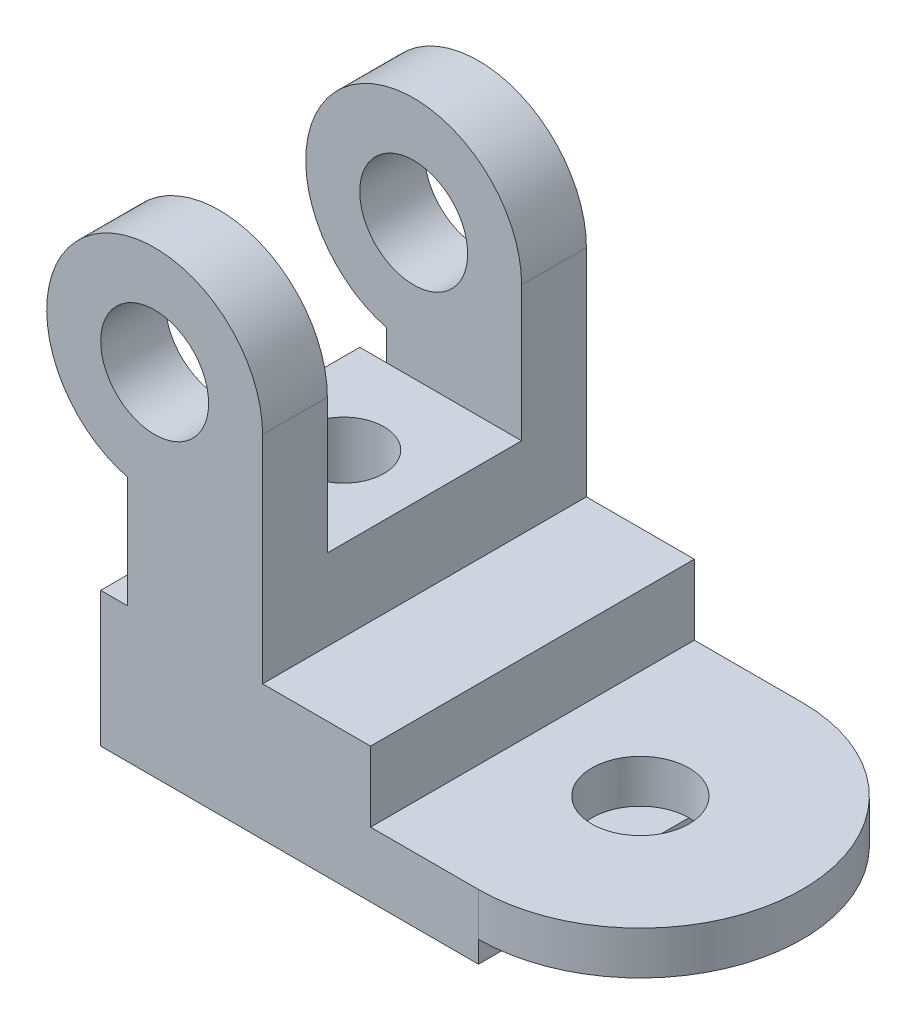
ISO-10303-21;
HEADER;
FILE_DESCRIPTION(('STEP AP214'),'2;1');
FILE_NAME('part.step','',(''),(''),'','','');
FILE_SCHEMA(('AUTOMOTIVE_DESIGN { 1 0 10303 214 1 1 1 1 }'));
ENDSEC;
DATA;
#1=APPLICATION_CONTEXT('core data for automotive mechanical design processes');
#2=APPLICATION_PROTOCOL_DEFINITION('international standard','automotive_design',2000,#1);
#3=PRODUCT_CONTEXT('',#1,'mechanical');
#4=PRODUCT('Part','Part','',(#3));
#5=PRODUCT_RELATED_PRODUCT_CATEGORY('part','',(#4));
#6=PRODUCT_DEFINITION_FORMATION('','',#4);
#7=PRODUCT_DEFINITION_CONTEXT('part definition',#1,'design');
#8=PRODUCT_DEFINITION('design','',#6,#7);
#9=PRODUCT_DEFINITION_SHAPE('','',#8);
#10=(LENGTH_UNIT() NAMED_UNIT(*) SI_UNIT(.MILLI.,.METRE.));
#11=(NAMED_UNIT(*) PLANE_ANGLE_UNIT() SI_UNIT($,.RADIAN.));
#12=(NAMED_UNIT(*) SI_UNIT($,.STERADIAN.) SOLID_ANGLE_UNIT());
#13=UNCERTAINTY_MEASURE_WITH_UNIT(LENGTH_MEASURE(1.E-05),#10,'distance_accuracy_value','');
#14=(GEOMETRIC_REPRESENTATION_CONTEXT(3) GLOBAL_UNCERTAINTY_ASSIGNED_CONTEXT((#13)) GLOBAL_UNIT_ASSIGNED_CONTEXT((#10,
#11,#12)) REPRESENTATION_CONTEXT('',''));
#15=CARTESIAN_POINT('',(0.,0.,0.));
#16=DIRECTION('',(0.,0.,1.));
#17=DIRECTION('',(1.,0.,0.));
#18=AXIS2_PLACEMENT_3D('',#15,#16,#17);
#19=CARTESIAN_POINT('',(-30.,0.,30.));
#20=DIRECTION('',(1.,0.,0.));
#21=DIRECTION('',(0.,1.,0.));
#22=AXIS2_PLACEMENT_3D('',#19,#20,#21);
#23=PLANE('',#22);
#24=DIRECTION('',(0.,-1.,0.));
#25=VECTOR('',#24,1.);
#26=CARTESIAN_POINT('',(-30.,0.,18.));
#27=LINE('',#26,#25);
#28=CARTESIAN_POINT('',(-30.,45.6350832689629,18.));
#29=VERTEX_POINT('',#28);
#30=CARTESIAN_POINT('',(-30.,40.,18.));
#31=VERTEX_POINT('',#30);
#32=EDGE_CURVE('E226',#29,#31,#27,.T.);
#33=ORIENTED_EDGE('',*,*,#32,.T.);
#34=DIRECTION('',(0.,-1.,0.));
#35=VECTOR('',#34,1.);
#36=CARTESIAN_POINT('',(-30.,0.,18.));
#37=LINE('',#36,#35);
#38=CARTESIAN_POINT('',(-30.,25.,18.));
#39=VERTEX_POINT('',#38);
#40=EDGE_CURVE('E484',#31,#39,#37,.T.);
#41=ORIENTED_EDGE('',*,*,#40,.T.);
#42=DIRECTION('',(0.,0.,-1.));
#43=VECTOR('',#42,1.);
#44=CARTESIAN_POINT('',(-30.,25.,30.));
#45=LINE('',#44,#43);
#46=CARTESIAN_POINT('',(-30.,25.,30.));
#47=VERTEX_POINT('',#46);
#48=EDGE_CURVE('E186',#47,#39,#45,.T.);
#49=ORIENTED_EDGE('',*,*,#48,.F.);
#50=DIRECTION('',(0.,-1.,0.));
#51=VECTOR('',#50,1.);
#52=CARTESIAN_POINT('',(-30.,0.,30.));
#53=LINE('',#52,#51);
#54=CARTESIAN_POINT('',(-30.,45.6350832689629,30.));
#55=VERTEX_POINT('',#54);
#56=EDGE_CURVE('E264',#55,#47,#53,.T.);
#57=ORIENTED_EDGE('',*,*,#56,.F.);
#58=DIRECTION('',(0.,0.,-1.));
#59=VECTOR('',#58,1.);
#60=CARTESIAN_POINT('',(-30.,45.6350832689629,30.));
#61=LINE('',#60,#59);
#62=EDGE_CURVE('E202',#55,#29,#61,.T.);
#63=ORIENTED_EDGE('',*,*,#62,.T.);
#64=EDGE_LOOP('',(#33,#41,#49,#57,#63));
#65=FACE_BOUND('',#64,.T.);
#66=ADVANCED_FACE('F35',(#65),#23,.F.);
#67=CARTESIAN_POINT('',(0.,25.,30.));
#68=DIRECTION('',(0.,-1.,0.));
#69=DIRECTION('',(0.,0.,-1.));
#70=AXIS2_PLACEMENT_3D('',#67,#68,#69);
#71=PLANE('',#70);
#72=ORIENTED_EDGE('',*,*,#48,.T.);
#73=DIRECTION('',(1.,0.,0.));
#74=VECTOR('',#73,1.);
#75=CARTESIAN_POINT('',(-4.99999999999999,25.,18.));
#76=LINE('',#75,#74);
#77=CARTESIAN_POINT('',(-35.,25.,18.));
#78=VERTEX_POINT('',#77);
#79=EDGE_CURVE('E171',#78,#39,#76,.T.);
#80=ORIENTED_EDGE('',*,*,#79,.F.);
#81=DIRECTION('',(0.,0.,-1.));
#82=VECTOR('',#81,1.);
#83=CARTESIAN_POINT('',(-35.,25.,30.));
#84=LINE('',#83,#82);
#85=CARTESIAN_POINT('',(-35.,25.,30.));
#86=VERTEX_POINT('',#85);
#87=EDGE_CURVE('E183',#86,#78,#84,.T.);
#88=ORIENTED_EDGE('',*,*,#87,.F.);
#89=DIRECTION('',(-1.,0.,0.));
#90=VECTOR('',#89,1.);
#91=CARTESIAN_POINT('',(0.,25.,30.));
#92=LINE('',#91,#90);
#93=EDGE_CURVE('E267',#47,#86,#92,.T.);
#94=ORIENTED_EDGE('',*,*,#93,.F.);
#95=EDGE_LOOP('',(#72,#80,#88,#94));
#96=FACE_BOUND('',#95,.T.);
#97=ADVANCED_FACE('F182',(#96),#71,.F.);
#98=CARTESIAN_POINT('',(-25.,65.,30.));
#99=DIRECTION('',(0.,0.,-1.));
#100=DIRECTION('',(-1.,0.,0.));
#101=AXIS2_PLACEMENT_3D('',#98,#99,#100);
#102=CYLINDRICAL_SURFACE('',#101,20.);
#103=CARTESIAN_POINT('',(-30.,45.6350832689629,-18.));
#104=VERTEX_POINT('',#103);
#105=CARTESIAN_POINT('',(-30.,45.6350832689629,-30.));
#106=VERTEX_POINT('',#105);
#107=EDGE_CURVE('E201',#104,#106,#61,.T.);
#108=ORIENTED_EDGE('',*,*,#107,.F.);
#109=CARTESIAN_POINT('',(-25.,65.,-18.));
#110=DIRECTION('',(0.,0.,-1.));
#111=DIRECTION('',(0.,1.,0.));
#112=AXIS2_PLACEMENT_3D('',#109,#110,#111);
#113=CIRCLE('',#112,20.);
#114=CARTESIAN_POINT('',(-5.,65.,-18.));
#115=VERTEX_POINT('',#114);
#116=EDGE_CURVE('E211',#104,#115,#113,.T.);
#117=ORIENTED_EDGE('',*,*,#116,.T.);
#118=DIRECTION('',(0.,0.,-1.));
#119=VECTOR('',#118,1.);
#120=CARTESIAN_POINT('',(-5.,65.,30.));
#121=LINE('',#120,#119);
#122=CARTESIAN_POINT('',(-5.,65.,-30.));
#123=VERTEX_POINT('',#122);
#124=EDGE_CURVE('E44',#115,#123,#121,.T.);
#125=ORIENTED_EDGE('',*,*,#124,.T.);
#126=CARTESIAN_POINT('',(-25.,65.,-30.));
#127=DIRECTION('',(0.,0.,1.));
#128=DIRECTION('',(1.,0.,0.));
#129=AXIS2_PLACEMENT_3D('',#126,#127,#128);
#130=CIRCLE('',#129,20.);
#131=EDGE_CURVE('E290',#123,#106,#130,.T.);
#132=ORIENTED_EDGE('',*,*,#131,.T.);
#133=EDGE_LOOP('',(#108,#117,#125,#132));
#134=FACE_BOUND('',#133,.T.);
#135=ADVANCED_FACE('F346',(#134),#102,.T.);
#136=CARTESIAN_POINT('',(-25.,65.,30.));
#137=DIRECTION('',(0.,0.,-1.));
#138=DIRECTION('',(-1.,0.,0.));
#139=AXIS2_PLACEMENT_3D('',#136,#137,#138);
#140=CYLINDRICAL_SURFACE('',#139,10.);
#141=CARTESIAN_POINT('',(-25.,65.,18.));
#142=DIRECTION('',(0.,0.,1.));
#143=DIRECTION('',(0.,-1.,0.));
#144=AXIS2_PLACEMENT_3D('',#141,#142,#143);
#145=CIRCLE('',#144,10.);
#146=CARTESIAN_POINT('',(-25.,55.,18.));
#147=VERTEX_POINT('',#146);
#148=EDGE_CURVE('E39',#147,#147,#145,.T.);
#149=ORIENTED_EDGE('',*,*,#148,.F.);
#150=EDGE_LOOP('',(#149));
#151=FACE_BOUND('',#150,.T.);
#152=CARTESIAN_POINT('',(-25.,65.,30.));
#153=DIRECTION('',(0.,0.,1.));
#154=DIRECTION('',(1.,0.,0.));
#155=AXIS2_PLACEMENT_3D('',#152,#153,#154);
#156=CIRCLE('',#155,10.);
#157=CARTESIAN_POINT('',(-15.,65.,30.));
#158=VERTEX_POINT('',#157);
#159=EDGE_CURVE('E254',#158,#158,#156,.T.);
#160=ORIENTED_EDGE('',*,*,#159,.T.);
#161=EDGE_LOOP('',(#160));
#162=FACE_BOUND('',#161,.T.);
#163=ADVANCED_FACE('F411',(#151,#162),#140,.F.);
#164=CARTESIAN_POINT('',(35.,0.,30.));
#165=DIRECTION('',(-1.,0.,0.));
#166=DIRECTION('',(0.,0.,1.));
#167=AXIS2_PLACEMENT_3D('',#164,#165,#166);
#168=PLANE('',#167);
#169=DIRECTION('',(0.,0.,-1.));
#170=VECTOR('',#169,1.);
#171=CARTESIAN_POINT('',(35.,4.00000000000001,30.));
#172=LINE('',#171,#170);
#173=CARTESIAN_POINT('',(35.,4.00000000000001,30.));
#174=VERTEX_POINT('',#173);
#175=CARTESIAN_POINT('',(35.,4.00000000000001,9.));
#176=VERTEX_POINT('',#175);
#177=EDGE_CURVE('E249',#174,#176,#172,.T.);
#178=ORIENTED_EDGE('',*,*,#177,.F.);
#179=DIRECTION('',(0.,1.,0.));
#180=VECTOR('',#179,1.);
#181=CARTESIAN_POINT('',(35.,0.,30.));
#182=LINE('',#181,#180);
#183=CARTESIAN_POINT('',(35.,0.,30.));
#184=VERTEX_POINT('',#183);
#185=EDGE_CURVE('E273',#184,#174,#182,.T.);
#186=ORIENTED_EDGE('',*,*,#185,.F.);
#187=DIRECTION('',(0.,0.,-1.));
#188=VECTOR('',#187,1.);
#189=CARTESIAN_POINT('',(35.,0.,30.));
#190=LINE('',#189,#188);
#191=CARTESIAN_POINT('',(35.,0.,-30.));
#192=VERTEX_POINT('',#191);
#193=EDGE_CURVE('E322',#184,#192,#190,.T.);
#194=ORIENTED_EDGE('',*,*,#193,.T.);
#195=DIRECTION('',(0.,1.,0.));
#196=VECTOR('',#195,1.);
#197=CARTESIAN_POINT('',(35.,0.,-30.));
#198=LINE('',#197,#196);
#199=CARTESIAN_POINT('',(35.,4.00000000000001,-30.));
#200=VERTEX_POINT('',#199);
#201=EDGE_CURVE('E305',#192,#200,#198,.T.);
#202=ORIENTED_EDGE('',*,*,#201,.T.);
#203=CARTESIAN_POINT('',(35.,4.00000000000001,-9.));
#204=VERTEX_POINT('',#203);
#205=EDGE_CURVE('E247',#204,#200,#172,.T.);
#206=ORIENTED_EDGE('',*,*,#205,.F.);
#207=EDGE_CURVE('E253',#176,#204,#172,.T.);
#208=ORIENTED_EDGE('',*,*,#207,.F.);
#209=EDGE_LOOP('',(#178,#186,#194,#202,#206,#208));
#210=FACE_BOUND('',#209,.T.);
#211=ADVANCED_FACE('F369',(#210),#168,.F.);
#212=CARTESIAN_POINT('',(-4.99999999999999,0.,30.));
#213=DIRECTION('',(1.,0.,0.));
#214=DIRECTION('',(0.,1.,0.));
#215=AXIS2_PLACEMENT_3D('',#212,#213,#214);
#216=PLANE('',#215);
#217=DIRECTION('',(0.,1.,0.));
#218=VECTOR('',#217,1.);
#219=CARTESIAN_POINT('',(-5.00000000000001,104.778485803222,-18.));
#220=LINE('',#219,#218);
#221=CARTESIAN_POINT('',(-5.,40.,-18.));
#222=VERTEX_POINT('',#221);
#223=EDGE_CURVE('E220',#222,#115,#220,.T.);
#224=ORIENTED_EDGE('',*,*,#223,.F.);
#225=DIRECTION('',(0.,0.,-1.));
#226=VECTOR('',#225,1.);
#227=CARTESIAN_POINT('',(-5.,40.,18.));
#228=LINE('',#227,#226);
#229=CARTESIAN_POINT('',(-5.,40.,18.));
#230=VERTEX_POINT('',#229);
#231=EDGE_CURVE('E488',#230,#222,#228,.T.);
#232=ORIENTED_EDGE('',*,*,#231,.F.);
#233=DIRECTION('',(0.,-1.,0.));
#234=VECTOR('',#233,1.);
#235=CARTESIAN_POINT('',(-5.00000000000001,104.778485803222,18.));
#236=LINE('',#235,#234);
#237=CARTESIAN_POINT('',(-5.,65.,18.));
#238=VERTEX_POINT('',#237);
#239=EDGE_CURVE('E486',#238,#230,#236,.T.);
#240=ORIENTED_EDGE('',*,*,#239,.F.);
#241=CARTESIAN_POINT('',(-5.,65.,30.));
#242=VERTEX_POINT('',#241);
#243=EDGE_CURVE('E11',#242,#238,#121,.T.);
#244=ORIENTED_EDGE('',*,*,#243,.F.);
#245=DIRECTION('',(0.,-1.,0.));
#246=VECTOR('',#245,1.);
#247=CARTESIAN_POINT('',(-4.99999999999999,0.,30.));
#248=LINE('',#247,#246);
#249=CARTESIAN_POINT('',(-5.,25.,30.));
#250=VERTEX_POINT('',#249);
#251=EDGE_CURVE('E257',#242,#250,#248,.T.);
#252=ORIENTED_EDGE('',*,*,#251,.T.);
#253=DIRECTION('',(0.,0.,-1.));
#254=VECTOR('',#253,1.);
#255=CARTESIAN_POINT('',(-5.,25.,30.));
#256=LINE('',#255,#254);
#257=CARTESIAN_POINT('',(-5.,25.,-30.));
#258=VERTEX_POINT('',#257);
#259=EDGE_CURVE('E284',#250,#258,#256,.T.);
#260=ORIENTED_EDGE('',*,*,#259,.T.);
#261=DIRECTION('',(0.,-1.,0.));
#262=VECTOR('',#261,1.);
#263=CARTESIAN_POINT('',(-4.99999999999999,0.,-30.));
#264=LINE('',#263,#262);
#265=EDGE_CURVE('E287',#123,#258,#264,.T.);
#266=ORIENTED_EDGE('',*,*,#265,.F.);
#267=ORIENTED_EDGE('',*,*,#124,.F.);
#268=EDGE_LOOP('',(#224,#232,#240,#244,#252,#260,#266,#267));
#269=FACE_BOUND('',#268,.T.);
#270=ADVANCED_FACE('F351',(#269),#216,.T.);
#271=ORIENTED_EDGE('',*,*,#243,.T.);
#272=CARTESIAN_POINT('',(-25.,65.,18.));
#273=DIRECTION('',(0.,0.,1.));
#274=DIRECTION('',(0.,-1.,0.));
#275=AXIS2_PLACEMENT_3D('',#272,#273,#274);
#276=CIRCLE('',#275,20.);
#277=EDGE_CURVE('E229',#238,#29,#276,.T.);
#278=ORIENTED_EDGE('',*,*,#277,.T.);
#279=ORIENTED_EDGE('',*,*,#62,.F.);
#280=CARTESIAN_POINT('',(-25.,65.,30.));
#281=DIRECTION('',(0.,0.,1.));
#282=DIRECTION('',(1.,0.,0.));
#283=AXIS2_PLACEMENT_3D('',#280,#281,#282);
#284=CIRCLE('',#283,20.);
#285=EDGE_CURVE('E261',#242,#55,#284,.T.);
#286=ORIENTED_EDGE('',*,*,#285,.F.);
#287=EDGE_LOOP('',(#271,#278,#279,#286));
#288=FACE_BOUND('',#287,.T.);
#289=ADVANCED_FACE('F401',(#288),#102,.T.);
#290=CARTESIAN_POINT('',(-30.,25.,-18.));
#291=VERTEX_POINT('',#290);
#292=CARTESIAN_POINT('',(-30.,25.,-30.));
#293=VERTEX_POINT('',#292);
#294=EDGE_CURVE('E193',#291,#293,#45,.T.);
#295=ORIENTED_EDGE('',*,*,#294,.F.);
#296=DIRECTION('',(0.,1.,0.));
#297=VECTOR('',#296,1.);
#298=CARTESIAN_POINT('',(-30.,0.,-18.));
#299=LINE('',#298,#297);
#300=CARTESIAN_POINT('',(-30.,40.,-18.));
#301=VERTEX_POINT('',#300);
#302=EDGE_CURVE('E177',#291,#301,#299,.T.);
#303=ORIENTED_EDGE('',*,*,#302,.T.);
#304=DIRECTION('',(0.,1.,0.));
#305=VECTOR('',#304,1.);
#306=CARTESIAN_POINT('',(-30.,0.,-18.));
#307=LINE('',#306,#305);
#308=EDGE_CURVE('E206',#301,#104,#307,.T.);
#309=ORIENTED_EDGE('',*,*,#308,.T.);
#310=ORIENTED_EDGE('',*,*,#107,.T.);
#311=DIRECTION('',(0.,-1.,0.));
#312=VECTOR('',#311,1.);
#313=CARTESIAN_POINT('',(-30.,0.,-30.));
#314=LINE('',#313,#312);
#315=EDGE_CURVE('E293',#106,#293,#314,.T.);
#316=ORIENTED_EDGE('',*,*,#315,.T.);
#317=EDGE_LOOP('',(#295,#303,#309,#310,#316));
#318=FACE_BOUND('',#317,.T.);
#319=ADVANCED_FACE('F342',(#318),#23,.F.);
#320=CARTESIAN_POINT('',(-35.,25.,-18.));
#321=VERTEX_POINT('',#320);
#322=CARTESIAN_POINT('',(-35.,25.,-30.));
#323=VERTEX_POINT('',#322);
#324=EDGE_CURVE('E194',#321,#323,#84,.T.);
#325=ORIENTED_EDGE('',*,*,#324,.F.);
#326=DIRECTION('',(-1.,0.,0.));
#327=VECTOR('',#326,1.);
#328=CARTESIAN_POINT('',(-4.99999999999999,25.,-18.));
#329=LINE('',#328,#327);
#330=EDGE_CURVE('E187',#291,#321,#329,.T.);
#331=ORIENTED_EDGE('',*,*,#330,.F.);
#332=ORIENTED_EDGE('',*,*,#294,.T.);
#333=DIRECTION('',(-1.,0.,0.));
#334=VECTOR('',#333,1.);
#335=CARTESIAN_POINT('',(0.,25.,-30.));
#336=LINE('',#335,#334);
#337=EDGE_CURVE('E296',#293,#323,#336,.T.);
#338=ORIENTED_EDGE('',*,*,#337,.T.);
#339=EDGE_LOOP('',(#325,#331,#332,#338));
#340=FACE_BOUND('',#339,.T.);
#341=ADVANCED_FACE('F337',(#340),#71,.F.);
#342=CARTESIAN_POINT('',(-35.,0.,30.));
#343=DIRECTION('',(-1.,0.,0.));
#344=DIRECTION('',(0.,0.,1.));
#345=AXIS2_PLACEMENT_3D('',#342,#343,#344);
#346=PLANE('',#345);
#347=DIRECTION('',(0.,1.,0.));
#348=VECTOR('',#347,1.);
#349=CARTESIAN_POINT('',(-35.,0.,-30.));
#350=LINE('',#349,#348);
#351=CARTESIAN_POINT('',(-35.,0.,-30.));
#352=VERTEX_POINT('',#351);
#353=EDGE_CURVE('E299',#352,#323,#350,.T.);
#354=ORIENTED_EDGE('',*,*,#353,.F.);
#355=DIRECTION('',(0.,0.,-1.));
#356=VECTOR('',#355,1.);
#357=CARTESIAN_POINT('',(-35.,0.,30.));
#358=LINE('',#357,#356);
#359=CARTESIAN_POINT('',(-35.,0.,30.));
#360=VERTEX_POINT('',#359);
#361=EDGE_CURVE('E197',#360,#352,#358,.T.);
#362=ORIENTED_EDGE('',*,*,#361,.F.);
#363=DIRECTION('',(0.,1.,0.));
#364=VECTOR('',#363,1.);
#365=CARTESIAN_POINT('',(-35.,0.,30.));
#366=LINE('',#365,#364);
#367=EDGE_CURVE('E192',#360,#86,#366,.T.);
#368=ORIENTED_EDGE('',*,*,#367,.T.);
#369=ORIENTED_EDGE('',*,*,#87,.T.);
#370=DIRECTION('',(0.,1.,0.));
#371=VECTOR('',#370,1.);
#372=CARTESIAN_POINT('',(-35.,25.,18.));
#373=LINE('',#372,#371);
#374=CARTESIAN_POINT('',(-35.,40.,18.));
#375=VERTEX_POINT('',#374);
#376=EDGE_CURVE('E168',#78,#375,#373,.T.);
#377=ORIENTED_EDGE('',*,*,#376,.T.);
#378=DIRECTION('',(0.,0.,1.));
#379=VECTOR('',#378,1.);
#380=CARTESIAN_POINT('',(-35.,40.,-18.));
#381=LINE('',#380,#379);
#382=CARTESIAN_POINT('',(-35.,40.,-18.));
#383=VERTEX_POINT('',#382);
#384=EDGE_CURVE('E479',#383,#375,#381,.T.);
#385=ORIENTED_EDGE('',*,*,#384,.F.);
#386=DIRECTION('',(0.,1.,0.));
#387=VECTOR('',#386,1.);
#388=CARTESIAN_POINT('',(-35.,25.,-18.));
#389=LINE('',#388,#387);
#390=EDGE_CURVE('E52',#321,#383,#389,.T.);
#391=ORIENTED_EDGE('',*,*,#390,.F.);
#392=ORIENTED_EDGE('',*,*,#324,.T.);
#393=EDGE_LOOP('',(#354,#362,#368,#369,#377,#385,#391,#392));
#394=FACE_BOUND('',#393,.T.);
#395=ADVANCED_FACE('F190',(#394),#346,.T.);
#396=CARTESIAN_POINT('',(0.,0.,30.));
#397=DIRECTION('',(0.,1.,0.));
#398=DIRECTION('',(0.,0.,1.));
#399=AXIS2_PLACEMENT_3D('',#396,#397,#398);
#400=PLANE('',#399);
#401=CARTESIAN_POINT('',(-20.,0.,0.));
#402=DIRECTION('',(0.,1.,0.));
#403=DIRECTION('',(-1.,0.,0.));
#404=AXIS2_PLACEMENT_3D('',#401,#402,#403);
#405=CIRCLE('',#404,7.5);
#406=CARTESIAN_POINT('',(-27.5,0.,0.));
#407=VERTEX_POINT('',#406);
#408=EDGE_CURVE('E469',#407,#407,#405,.T.);
#409=ORIENTED_EDGE('',*,*,#408,.T.);
#410=EDGE_LOOP('',(#409));
#411=FACE_BOUND('',#410,.T.);
#412=DIRECTION('',(1.,0.,0.));
#413=VECTOR('',#412,1.);
#414=CARTESIAN_POINT('',(0.,0.,-30.));
#415=LINE('',#414,#413);
#416=EDGE_CURVE('E302',#352,#192,#415,.T.);
#417=ORIENTED_EDGE('',*,*,#416,.T.);
#418=ORIENTED_EDGE('',*,*,#193,.F.);
#419=DIRECTION('',(1.,0.,0.));
#420=VECTOR('',#419,1.);
#421=CARTESIAN_POINT('',(0.,0.,30.));
#422=LINE('',#421,#420);
#423=EDGE_CURVE('E270',#360,#184,#422,.T.);
#424=ORIENTED_EDGE('',*,*,#423,.F.);
#425=ORIENTED_EDGE('',*,*,#361,.T.);
#426=EDGE_LOOP('',(#417,#418,#424,#425));
#427=FACE_BOUND('',#426,.T.);
#428=ADVANCED_FACE('F329',(#411,#427),#400,.F.);
#429=CARTESIAN_POINT('',(0.,12.,30.));
#430=DIRECTION('',(0.,-1.,0.));
#431=DIRECTION('',(0.,0.,-1.));
#432=AXIS2_PLACEMENT_3D('',#429,#430,#431);
#433=PLANE('',#432);
#434=CARTESIAN_POINT('',(35.,12.,0.));
#435=DIRECTION('',(0.,1.,0.));
#436=DIRECTION('',(0.,0.,1.));
#437=AXIS2_PLACEMENT_3D('',#434,#435,#436);
#438=CIRCLE('',#437,9.);
#439=CARTESIAN_POINT('',(35.,12.,9.));
#440=VERTEX_POINT('',#439);
#441=EDGE_CURVE('E231',#440,#440,#438,.T.);
#442=ORIENTED_EDGE('',*,*,#441,.F.);
#443=EDGE_LOOP('',(#442));
#444=FACE_BOUND('',#443,.T.);
#445=DIRECTION('',(-1.,0.,0.));
#446=VECTOR('',#445,1.);
#447=CARTESIAN_POINT('',(0.,12.,-30.));
#448=LINE('',#447,#446);
#449=CARTESIAN_POINT('',(35.,12.,-30.));
#450=VERTEX_POINT('',#449);
#451=CARTESIAN_POINT('',(15.,12.,-30.));
#452=VERTEX_POINT('',#451);
#453=EDGE_CURVE('E308',#450,#452,#448,.T.);
#454=ORIENTED_EDGE('',*,*,#453,.T.);
#455=DIRECTION('',(0.,0.,-1.));
#456=VECTOR('',#455,1.);
#457=CARTESIAN_POINT('',(15.,12.,30.));
#458=LINE('',#457,#456);
#459=CARTESIAN_POINT('',(15.,12.,30.));
#460=VERTEX_POINT('',#459);
#461=EDGE_CURVE('E320',#460,#452,#458,.T.);
#462=ORIENTED_EDGE('',*,*,#461,.F.);
#463=DIRECTION('',(-1.,0.,0.));
#464=VECTOR('',#463,1.);
#465=CARTESIAN_POINT('',(0.,12.,30.));
#466=LINE('',#465,#464);
#467=CARTESIAN_POINT('',(35.,12.,30.));
#468=VERTEX_POINT('',#467);
#469=EDGE_CURVE('E276',#468,#460,#466,.T.);
#470=ORIENTED_EDGE('',*,*,#469,.F.);
#471=CARTESIAN_POINT('',(35.,12.,0.));
#472=DIRECTION('',(0.,1.,0.));
#473=DIRECTION('',(0.,0.,1.));
#474=AXIS2_PLACEMENT_3D('',#471,#472,#473);
#475=CIRCLE('',#474,30.);
#476=EDGE_CURVE('E235',#468,#450,#475,.T.);
#477=ORIENTED_EDGE('',*,*,#476,.T.);
#478=EDGE_LOOP('',(#454,#462,#470,#477));
#479=FACE_BOUND('',#478,.T.);
#480=ADVANCED_FACE('F362',(#444,#479),#433,.F.);
#481=CARTESIAN_POINT('',(15.,0.,30.));
#482=DIRECTION('',(-1.,0.,0.));
#483=DIRECTION('',(0.,0.,1.));
#484=AXIS2_PLACEMENT_3D('',#481,#482,#483);
#485=PLANE('',#484);
#486=DIRECTION('',(0.,1.,0.));
#487=VECTOR('',#486,1.);
#488=CARTESIAN_POINT('',(15.,0.,-30.));
#489=LINE('',#488,#487);
#490=CARTESIAN_POINT('',(15.,25.,-30.));
#491=VERTEX_POINT('',#490);
#492=EDGE_CURVE('E311',#452,#491,#489,.T.);
#493=ORIENTED_EDGE('',*,*,#492,.T.);
#494=DIRECTION('',(0.,0.,-1.));
#495=VECTOR('',#494,1.);
#496=CARTESIAN_POINT('',(15.,25.,30.));
#497=LINE('',#496,#495);
#498=CARTESIAN_POINT('',(15.,25.,30.));
#499=VERTEX_POINT('',#498);
#500=EDGE_CURVE('E317',#499,#491,#497,.T.);
#501=ORIENTED_EDGE('',*,*,#500,.F.);
#502=DIRECTION('',(0.,1.,0.));
#503=VECTOR('',#502,1.);
#504=CARTESIAN_POINT('',(15.,0.,30.));
#505=LINE('',#504,#503);
#506=EDGE_CURVE('E279',#460,#499,#505,.T.);
#507=ORIENTED_EDGE('',*,*,#506,.F.);
#508=ORIENTED_EDGE('',*,*,#461,.T.);
#509=EDGE_LOOP('',(#493,#501,#507,#508));
#510=FACE_BOUND('',#509,.T.);
#511=ADVANCED_FACE('F359',(#510),#485,.F.);
#512=CARTESIAN_POINT('',(-25.,65.,-18.));
#513=DIRECTION('',(0.,0.,-1.));
#514=DIRECTION('',(0.,1.,0.));
#515=AXIS2_PLACEMENT_3D('',#512,#513,#514);
#516=CIRCLE('',#515,10.);
#517=CARTESIAN_POINT('',(-25.,75.,-18.));
#518=VERTEX_POINT('',#517);
#519=EDGE_CURVE('E204',#518,#518,#516,.T.);
#520=ORIENTED_EDGE('',*,*,#519,.F.);
#521=EDGE_LOOP('',(#520));
#522=FACE_BOUND('',#521,.T.);
#523=CARTESIAN_POINT('',(-25.,65.,-30.));
#524=DIRECTION('',(0.,0.,1.));
#525=DIRECTION('',(1.,0.,0.));
#526=AXIS2_PLACEMENT_3D('',#523,#524,#525);
#527=CIRCLE('',#526,10.);
#528=CARTESIAN_POINT('',(-15.,65.,-30.));
#529=VERTEX_POINT('',#528);
#530=EDGE_CURVE('E252',#529,#529,#527,.T.);
#531=ORIENTED_EDGE('',*,*,#530,.F.);
#532=EDGE_LOOP('',(#531));
#533=FACE_BOUND('',#532,.T.);
#534=ADVANCED_FACE('F37',(#522,#533),#140,.F.);
#535=CARTESIAN_POINT('',(0.,25.,30.));
#536=DIRECTION('',(0.,-1.,0.));
#537=DIRECTION('',(1.,0.,0.));
#538=AXIS2_PLACEMENT_3D('',#535,#536,#537);
#539=PLANE('',#538);
#540=DIRECTION('',(-1.,0.,0.));
#541=VECTOR('',#540,1.);
#542=CARTESIAN_POINT('',(0.,25.,-30.));
#543=LINE('',#542,#541);
#544=EDGE_CURVE('E258',#491,#258,#543,.T.);
#545=ORIENTED_EDGE('',*,*,#544,.T.);
#546=ORIENTED_EDGE('',*,*,#259,.F.);
#547=DIRECTION('',(-1.,0.,0.));
#548=VECTOR('',#547,1.);
#549=CARTESIAN_POINT('',(0.,25.,30.));
#550=LINE('',#549,#548);
#551=EDGE_CURVE('E282',#499,#250,#550,.T.);
#552=ORIENTED_EDGE('',*,*,#551,.F.);
#553=ORIENTED_EDGE('',*,*,#500,.T.);
#554=EDGE_LOOP('',(#545,#546,#552,#553));
#555=FACE_BOUND('',#554,.T.);
#556=ADVANCED_FACE('F355',(#555),#539,.F.);
#557=CARTESIAN_POINT('',(0.,0.,30.));
#558=DIRECTION('',(0.,0.,1.));
#559=DIRECTION('',(1.,0.,0.));
#560=AXIS2_PLACEMENT_3D('',#557,#558,#559);
#561=PLANE('',#560);
#562=ORIENTED_EDGE('',*,*,#469,.T.);
#563=ORIENTED_EDGE('',*,*,#506,.T.);
#564=ORIENTED_EDGE('',*,*,#551,.T.);
#565=ORIENTED_EDGE('',*,*,#251,.F.);
#566=ORIENTED_EDGE('',*,*,#285,.T.);
#567=ORIENTED_EDGE('',*,*,#56,.T.);
#568=ORIENTED_EDGE('',*,*,#93,.T.);
#569=ORIENTED_EDGE('',*,*,#367,.F.);
#570=ORIENTED_EDGE('',*,*,#423,.T.);
#571=ORIENTED_EDGE('',*,*,#185,.T.);
#572=DIRECTION('',(0.,1.,0.));
#573=VECTOR('',#572,1.);
#574=CARTESIAN_POINT('',(35.,4.00000000000001,30.));
#575=LINE('',#574,#573);
#576=EDGE_CURVE('E241',#174,#468,#575,.T.);
#577=ORIENTED_EDGE('',*,*,#576,.T.);
#578=EDGE_LOOP('',(#562,#563,#564,#565,#566,#567,#568,#569,#570,#571,#577));
#579=FACE_BOUND('',#578,.T.);
#580=ORIENTED_EDGE('',*,*,#159,.F.);
#581=EDGE_LOOP('',(#580));
#582=FACE_BOUND('',#581,.T.);
#583=ADVANCED_FACE('F426',(#579,#582),#561,.T.);
#584=CARTESIAN_POINT('',(0.,0.,-30.));
#585=DIRECTION('',(0.,0.,1.));
#586=DIRECTION('',(1.,0.,0.));
#587=AXIS2_PLACEMENT_3D('',#584,#585,#586);
#588=PLANE('',#587);
#589=ORIENTED_EDGE('',*,*,#530,.T.);
#590=EDGE_LOOP('',(#589));
#591=FACE_BOUND('',#590,.T.);
#592=ORIENTED_EDGE('',*,*,#492,.F.);
#593=ORIENTED_EDGE('',*,*,#453,.F.);
#594=DIRECTION('',(0.,1.,0.));
#595=VECTOR('',#594,1.);
#596=CARTESIAN_POINT('',(35.,4.00000000000001,-30.));
#597=LINE('',#596,#595);
#598=EDGE_CURVE('E244',#200,#450,#597,.T.);
#599=ORIENTED_EDGE('',*,*,#598,.F.);
#600=ORIENTED_EDGE('',*,*,#201,.F.);
#601=ORIENTED_EDGE('',*,*,#416,.F.);
#602=ORIENTED_EDGE('',*,*,#353,.T.);
#603=ORIENTED_EDGE('',*,*,#337,.F.);
#604=ORIENTED_EDGE('',*,*,#315,.F.);
#605=ORIENTED_EDGE('',*,*,#131,.F.);
#606=ORIENTED_EDGE('',*,*,#265,.T.);
#607=ORIENTED_EDGE('',*,*,#544,.F.);
#608=EDGE_LOOP('',(#592,#593,#599,#600,#601,#602,#603,#604,#605,#606,#607));
#609=FACE_BOUND('',#608,.T.);
#610=ADVANCED_FACE('F331',(#591,#609),#588,.F.);
#611=CARTESIAN_POINT('',(35.,4.00000000000001,0.));
#612=DIRECTION('',(0.,1.,0.));
#613=DIRECTION('',(0.,0.,1.));
#614=AXIS2_PLACEMENT_3D('',#611,#612,#613);
#615=PLANE('',#614);
#616=ORIENTED_EDGE('',*,*,#177,.T.);
#617=CARTESIAN_POINT('',(35.,4.00000000000001,0.));
#618=DIRECTION('',(0.,1.,0.));
#619=DIRECTION('',(0.,0.,1.));
#620=AXIS2_PLACEMENT_3D('',#617,#618,#619);
#621=CIRCLE('',#620,9.);
#622=EDGE_CURVE('E232',#176,#204,#621,.T.);
#623=ORIENTED_EDGE('',*,*,#622,.T.);
#624=ORIENTED_EDGE('',*,*,#205,.T.);
#625=CARTESIAN_POINT('',(35.,4.00000000000001,0.));
#626=DIRECTION('',(0.,1.,0.));
#627=DIRECTION('',(0.,0.,1.));
#628=AXIS2_PLACEMENT_3D('',#625,#626,#627);
#629=CIRCLE('',#628,30.);
#630=EDGE_CURVE('E238',#174,#200,#629,.T.);
#631=ORIENTED_EDGE('',*,*,#630,.F.);
#632=EDGE_LOOP('',(#616,#623,#624,#631));
#633=FACE_BOUND('',#632,.T.);
#634=ADVANCED_FACE('F374',(#633),#615,.F.);
#635=CARTESIAN_POINT('',(35.,4.00000000000001,0.));
#636=DIRECTION('',(0.,1.,0.));
#637=DIRECTION('',(0.,0.,1.));
#638=AXIS2_PLACEMENT_3D('',#635,#636,#637);
#639=CYLINDRICAL_SURFACE('',#638,30.);
#640=ORIENTED_EDGE('',*,*,#476,.F.);
#641=ORIENTED_EDGE('',*,*,#576,.F.);
#642=ORIENTED_EDGE('',*,*,#630,.T.);
#643=ORIENTED_EDGE('',*,*,#598,.T.);
#644=EDGE_LOOP('',(#640,#641,#642,#643));
#645=FACE_BOUND('',#644,.T.);
#646=ADVANCED_FACE('F366',(#645),#639,.T.);
#647=CARTESIAN_POINT('',(35.,4.00000000000001,0.));
#648=DIRECTION('',(0.,1.,0.));
#649=DIRECTION('',(0.,0.,1.));
#650=AXIS2_PLACEMENT_3D('',#647,#648,#649);
#651=PLANE('',#650);
#652=ORIENTED_EDGE('',*,*,#207,.T.);
#653=EDGE_CURVE('E59',#204,#176,#621,.T.);
#654=ORIENTED_EDGE('',*,*,#653,.T.);
#655=EDGE_LOOP('',(#652,#654));
#656=FACE_BOUND('',#655,.T.);
#657=ADVANCED_FACE('F373',(#656),#651,.T.);
#658=CARTESIAN_POINT('',(35.,4.00000000000001,0.));
#659=DIRECTION('',(0.,1.,0.));
#660=DIRECTION('',(0.,0.,1.));
#661=AXIS2_PLACEMENT_3D('',#658,#659,#660);
#662=CYLINDRICAL_SURFACE('',#661,9.);
#663=ORIENTED_EDGE('',*,*,#622,.F.);
#664=ORIENTED_EDGE('',*,*,#653,.F.);
#665=EDGE_LOOP('',(#663,#664));
#666=FACE_BOUND('',#665,.T.);
#667=ORIENTED_EDGE('',*,*,#441,.T.);
#668=EDGE_LOOP('',(#667));
#669=FACE_BOUND('',#668,.T.);
#670=ADVANCED_FACE('F375',(#666,#669),#662,.F.);
#671=CARTESIAN_POINT('',(-45.,40.,18.));
#672=DIRECTION('',(0.,-1.,0.));
#673=DIRECTION('',(1.,0.,0.));
#674=AXIS2_PLACEMENT_3D('',#671,#672,#673);
#675=PLANE('',#674);
#676=CARTESIAN_POINT('',(-20.,40.,0.));
#677=DIRECTION('',(0.,1.,0.));
#678=DIRECTION('',(-1.,0.,0.));
#679=AXIS2_PLACEMENT_3D('',#676,#677,#678);
#680=CIRCLE('',#679,7.5);
#681=CARTESIAN_POINT('',(-27.5,40.,0.));
#682=VERTEX_POINT('',#681);
#683=EDGE_CURVE('E472',#682,#682,#680,.T.);
#684=ORIENTED_EDGE('',*,*,#683,.F.);
#685=EDGE_LOOP('',(#684));
#686=FACE_BOUND('',#685,.T.);
#687=DIRECTION('',(1.,0.,0.));
#688=VECTOR('',#687,1.);
#689=CARTESIAN_POINT('',(-45.,40.,18.));
#690=LINE('',#689,#688);
#691=EDGE_CURVE('E213',#31,#230,#690,.T.);
#692=ORIENTED_EDGE('',*,*,#691,.T.);
#693=ORIENTED_EDGE('',*,*,#231,.T.);
#694=DIRECTION('',(1.,0.,0.));
#695=VECTOR('',#694,1.);
#696=CARTESIAN_POINT('',(-45.,40.,-18.));
#697=LINE('',#696,#695);
#698=EDGE_CURVE('E207',#301,#222,#697,.T.);
#699=ORIENTED_EDGE('',*,*,#698,.F.);
#700=DIRECTION('',(-1.,0.,0.));
#701=VECTOR('',#700,1.);
#702=CARTESIAN_POINT('',(-5.,40.,-18.));
#703=LINE('',#702,#701);
#704=EDGE_CURVE('E474',#301,#383,#703,.T.);
#705=ORIENTED_EDGE('',*,*,#704,.T.);
#706=ORIENTED_EDGE('',*,*,#384,.T.);
#707=DIRECTION('',(1.,0.,0.));
#708=VECTOR('',#707,1.);
#709=CARTESIAN_POINT('',(-5.,40.,18.));
#710=LINE('',#709,#708);
#711=EDGE_CURVE('E174',#375,#31,#710,.T.);
#712=ORIENTED_EDGE('',*,*,#711,.T.);
#713=EDGE_LOOP('',(#692,#693,#699,#705,#706,#712));
#714=FACE_BOUND('',#713,.T.);
#715=ADVANCED_FACE('F378',(#686,#714),#675,.F.);
#716=CARTESIAN_POINT('',(-45.,104.778485803222,18.));
#717=DIRECTION('',(0.,0.,1.));
#718=DIRECTION('',(0.,-1.,0.));
#719=AXIS2_PLACEMENT_3D('',#716,#717,#718);
#720=PLANE('',#719);
#721=ORIENTED_EDGE('',*,*,#148,.T.);
#722=EDGE_LOOP('',(#721));
#723=FACE_BOUND('',#722,.T.);
#724=ORIENTED_EDGE('',*,*,#239,.T.);
#725=ORIENTED_EDGE('',*,*,#691,.F.);
#726=ORIENTED_EDGE('',*,*,#32,.F.);
#727=ORIENTED_EDGE('',*,*,#277,.F.);
#728=EDGE_LOOP('',(#724,#725,#726,#727));
#729=FACE_BOUND('',#728,.T.);
#730=ADVANCED_FACE('F445',(#723,#729),#720,.F.);
#731=CARTESIAN_POINT('',(-45.,104.778485803222,-18.));
#732=DIRECTION('',(0.,0.,-1.));
#733=DIRECTION('',(0.,1.,0.));
#734=AXIS2_PLACEMENT_3D('',#731,#732,#733);
#735=PLANE('',#734);
#736=ORIENTED_EDGE('',*,*,#519,.T.);
#737=EDGE_LOOP('',(#736));
#738=FACE_BOUND('',#737,.T.);
#739=ORIENTED_EDGE('',*,*,#116,.F.);
#740=ORIENTED_EDGE('',*,*,#308,.F.);
#741=ORIENTED_EDGE('',*,*,#698,.T.);
#742=ORIENTED_EDGE('',*,*,#223,.T.);
#743=EDGE_LOOP('',(#739,#740,#741,#742));
#744=FACE_BOUND('',#743,.T.);
#745=ADVANCED_FACE('F448',(#738,#744),#735,.F.);
#746=CARTESIAN_POINT('',(-4.99999999999999,25.,18.));
#747=DIRECTION('',(0.,0.,1.));
#748=DIRECTION('',(1.,0.,0.));
#749=AXIS2_PLACEMENT_3D('',#746,#747,#748);
#750=PLANE('',#749);
#751=ORIENTED_EDGE('',*,*,#40,.F.);
#752=ORIENTED_EDGE('',*,*,#711,.F.);
#753=ORIENTED_EDGE('',*,*,#376,.F.);
#754=ORIENTED_EDGE('',*,*,#79,.T.);
#755=EDGE_LOOP('',(#751,#752,#753,#754));
#756=FACE_BOUND('',#755,.T.);
#757=ADVANCED_FACE('F170',(#756),#750,.T.);
#758=CARTESIAN_POINT('',(-4.99999999999999,25.,-18.));
#759=DIRECTION('',(0.,0.,-1.));
#760=DIRECTION('',(-1.,0.,0.));
#761=AXIS2_PLACEMENT_3D('',#758,#759,#760);
#762=PLANE('',#761);
#763=ORIENTED_EDGE('',*,*,#302,.F.);
#764=ORIENTED_EDGE('',*,*,#330,.T.);
#765=ORIENTED_EDGE('',*,*,#390,.T.);
#766=ORIENTED_EDGE('',*,*,#704,.F.);
#767=EDGE_LOOP('',(#763,#764,#765,#766));
#768=FACE_BOUND('',#767,.T.);
#769=ADVANCED_FACE('F455',(#768),#762,.T.);
#770=CARTESIAN_POINT('',(-20.,0.,0.));
#771=DIRECTION('',(0.,1.,0.));
#772=DIRECTION('',(-1.,0.,0.));
#773=AXIS2_PLACEMENT_3D('',#770,#771,#772);
#774=CYLINDRICAL_SURFACE('',#773,7.5);
#775=ORIENTED_EDGE('',*,*,#408,.F.);
#776=EDGE_LOOP('',(#775));
#777=FACE_BOUND('',#776,.T.);
#778=ORIENTED_EDGE('',*,*,#683,.T.);
#779=EDGE_LOOP('',(#778));
#780=FACE_BOUND('',#779,.T.);
#781=ADVANCED_FACE('F458',(#777,#780),#774,.F.);
#782=CLOSED_SHELL('',(#66,#97,#135,#163,#211,#270,#289,#319,#341,#395,#428,#480,#511,#534,#556,
#583,#610,#634,#646,#657,#670,#715,#730,#745,#757,#769,#781));
#783=MANIFOLD_SOLID_BREP('B2',#782);
#784=ADVANCED_BREP_SHAPE_REPRESENTATION('',(#18,#783),#14);
#785=SHAPE_DEFINITION_REPRESENTATION(#9,#784);
ENDSEC;
END-ISO-10303-21;
